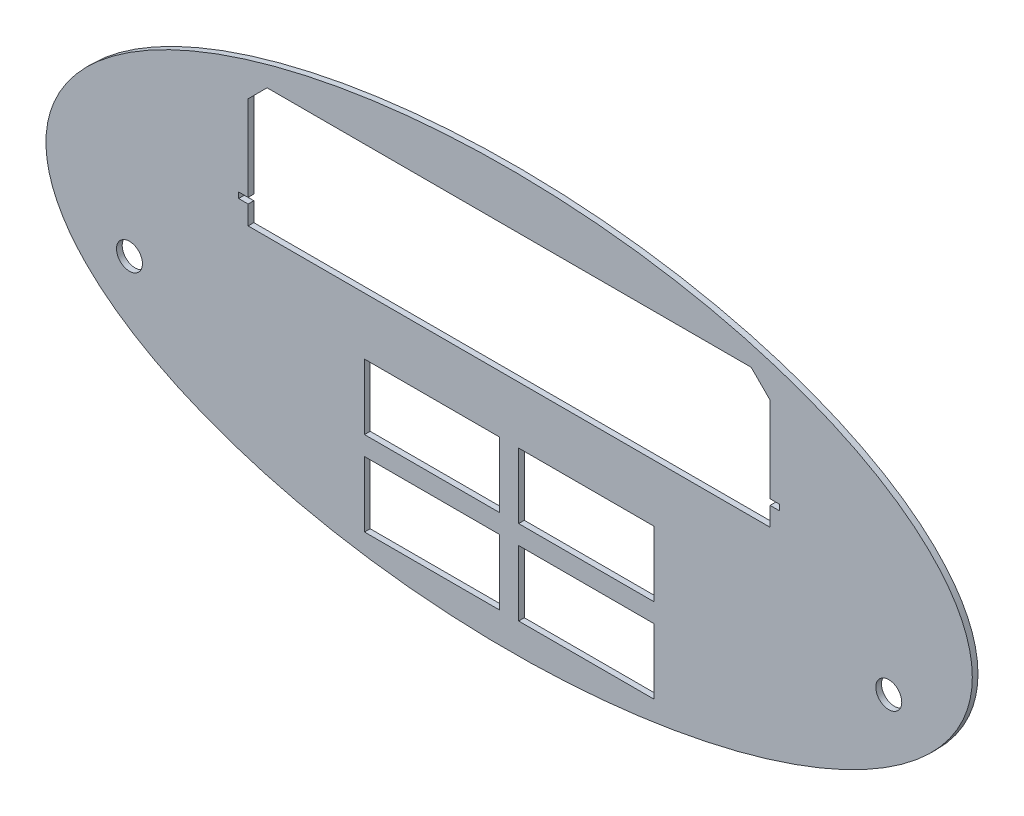
ISO-10303-21;
HEADER;
FILE_DESCRIPTION(('STEP AP214'),'2;1');
FILE_NAME('part.step','',(''),(''),'','','');
FILE_SCHEMA(('AUTOMOTIVE_DESIGN { 1 0 10303 214 1 1 1 1 }'));
ENDSEC;
DATA;
#1=APPLICATION_CONTEXT('core data for automotive mechanical design processes');
#2=APPLICATION_PROTOCOL_DEFINITION('international standard','automotive_design',2000,#1);
#3=PRODUCT_CONTEXT('',#1,'mechanical');
#4=PRODUCT('Part','Part','',(#3));
#5=PRODUCT_RELATED_PRODUCT_CATEGORY('part','',(#4));
#6=PRODUCT_DEFINITION_FORMATION('','',#4);
#7=PRODUCT_DEFINITION_CONTEXT('part definition',#1,'design');
#8=PRODUCT_DEFINITION('design','',#6,#7);
#9=PRODUCT_DEFINITION_SHAPE('','',#8);
#10=(LENGTH_UNIT() NAMED_UNIT(*) SI_UNIT(.MILLI.,.METRE.));
#11=(NAMED_UNIT(*) PLANE_ANGLE_UNIT() SI_UNIT($,.RADIAN.));
#12=(NAMED_UNIT(*) SI_UNIT($,.STERADIAN.) SOLID_ANGLE_UNIT());
#13=UNCERTAINTY_MEASURE_WITH_UNIT(LENGTH_MEASURE(1.E-05),#10,'distance_accuracy_value','');
#14=(GEOMETRIC_REPRESENTATION_CONTEXT(3) GLOBAL_UNCERTAINTY_ASSIGNED_CONTEXT((#13)) GLOBAL_UNIT_ASSIGNED_CONTEXT((#10,
#11,#12)) REPRESENTATION_CONTEXT('',''));
#15=CARTESIAN_POINT('',(0.,0.,0.));
#16=DIRECTION('',(0.,0.,1.));
#17=DIRECTION('',(1.,0.,0.));
#18=AXIS2_PLACEMENT_3D('',#15,#16,#17);
#19=CARTESIAN_POINT('',(0.,0.,-3.));
#20=DIRECTION('',(0.,0.,1.));
#21=DIRECTION('',(1.,0.,0.));
#22=AXIS2_PLACEMENT_3D('',#19,#20,#21);
#23=ELLIPSE('',#22,244.,110.);
#24=DIRECTION('',(0.,0.,1.));
#25=VECTOR('',#24,1.);
#26=SURFACE_OF_LINEAR_EXTRUSION('',#23,#25);
#27=CARTESIAN_POINT('',(244.,0.,-3.));
#28=VERTEX_POINT('',#27);
#29=EDGE_CURVE('E465',#28,#28,#23,.T.);
#30=ORIENTED_EDGE('',*,*,#29,.T.);
#31=EDGE_LOOP('',(#30));
#32=FACE_BOUND('',#31,.T.);
#33=CARTESIAN_POINT('',(0.,0.,0.));
#34=DIRECTION('',(0.,0.,1.));
#35=DIRECTION('',(1.,0.,0.));
#36=AXIS2_PLACEMENT_3D('',#33,#34,#35);
#37=ELLIPSE('',#36,244.,110.);
#38=CARTESIAN_POINT('',(244.,0.,0.));
#39=VERTEX_POINT('',#38);
#40=EDGE_CURVE('E446',#39,#39,#37,.T.);
#41=ORIENTED_EDGE('',*,*,#40,.F.);
#42=EDGE_LOOP('',(#41));
#43=FACE_BOUND('',#42,.T.);
#44=ADVANCED_FACE('F35',(#32,#43),#26,.T.);
#45=CARTESIAN_POINT('',(0.,0.,-3.));
#46=DIRECTION('',(0.,0.,1.));
#47=DIRECTION('',(1.,0.,0.));
#48=AXIS2_PLACEMENT_3D('',#45,#46,#47);
#49=PLANE('',#48);
#50=CARTESIAN_POINT('',(200.,-30.,-3.));
#51=DIRECTION('',(0.,0.,1.));
#52=DIRECTION('',(1.,0.,0.));
#53=AXIS2_PLACEMENT_3D('',#50,#51,#52);
#54=CIRCLE('',#53,6.83635541999999);
#55=CARTESIAN_POINT('',(206.83635542,-30.,-3.));
#56=VERTEX_POINT('',#55);
#57=EDGE_CURVE('E328',#56,#56,#54,.T.);
#58=ORIENTED_EDGE('',*,*,#57,.T.);
#59=EDGE_LOOP('',(#58));
#60=FACE_BOUND('',#59,.T.);
#61=CARTESIAN_POINT('',(-200.,-30.,-3.));
#62=DIRECTION('',(0.,0.,1.));
#63=DIRECTION('',(-1.,0.,0.));
#64=AXIS2_PLACEMENT_3D('',#61,#62,#63);
#65=CIRCLE('',#64,6.83635541999999);
#66=CARTESIAN_POINT('',(-206.83635542,-30.,-3.));
#67=VERTEX_POINT('',#66);
#68=EDGE_CURVE('E593',#67,#67,#65,.T.);
#69=ORIENTED_EDGE('',*,*,#68,.T.);
#70=EDGE_LOOP('',(#69));
#71=FACE_BOUND('',#70,.T.);
#72=DIRECTION('',(0.,1.,0.));
#73=VECTOR('',#72,1.);
#74=CARTESIAN_POINT('',(76.2,-15.,-3.));
#75=LINE('',#74,#73);
#76=CARTESIAN_POINT('',(76.2,-49.45,-3.));
#77=VERTEX_POINT('',#76);
#78=CARTESIAN_POINT('',(76.2,-15.,-3.));
#79=VERTEX_POINT('',#78);
#80=EDGE_CURVE('E321',#77,#79,#75,.T.);
#81=ORIENTED_EDGE('',*,*,#80,.T.);
#82=DIRECTION('',(-1.,0.,0.));
#83=VECTOR('',#82,1.);
#84=CARTESIAN_POINT('',(5.,-15.,-3.));
#85=LINE('',#84,#83);
#86=CARTESIAN_POINT('',(5.,-15.,-3.));
#87=VERTEX_POINT('',#86);
#88=EDGE_CURVE('E311',#79,#87,#85,.T.);
#89=ORIENTED_EDGE('',*,*,#88,.T.);
#90=DIRECTION('',(0.,-1.,0.));
#91=VECTOR('',#90,1.);
#92=CARTESIAN_POINT('',(5.,-15.,-3.));
#93=LINE('',#92,#91);
#94=CARTESIAN_POINT('',(5.00000000000001,-49.45,-3.));
#95=VERTEX_POINT('',#94);
#96=EDGE_CURVE('E314',#87,#95,#93,.T.);
#97=ORIENTED_EDGE('',*,*,#96,.T.);
#98=DIRECTION('',(1.,0.,0.));
#99=VECTOR('',#98,1.);
#100=CARTESIAN_POINT('',(5.00000000000001,-49.45,-3.));
#101=LINE('',#100,#99);
#102=EDGE_CURVE('E318',#95,#77,#101,.T.);
#103=ORIENTED_EDGE('',*,*,#102,.T.);
#104=EDGE_LOOP('',(#81,#89,#97,#103));
#105=FACE_BOUND('',#104,.T.);
#106=DIRECTION('',(-1.,0.,0.));
#107=VECTOR('',#106,1.);
#108=CARTESIAN_POINT('',(-76.2,-59.45,-3.));
#109=LINE('',#108,#107);
#110=CARTESIAN_POINT('',(-4.99999999999999,-59.45,-3.));
#111=VERTEX_POINT('',#110);
#112=CARTESIAN_POINT('',(-76.2,-59.45,-3.));
#113=VERTEX_POINT('',#112);
#114=EDGE_CURVE('E289',#111,#113,#109,.T.);
#115=ORIENTED_EDGE('',*,*,#114,.T.);
#116=DIRECTION('',(0.,-1.,0.));
#117=VECTOR('',#116,1.);
#118=CARTESIAN_POINT('',(-76.2,-59.45,-3.));
#119=LINE('',#118,#117);
#120=CARTESIAN_POINT('',(-76.2,-93.9,-3.));
#121=VERTEX_POINT('',#120);
#122=EDGE_CURVE('E279',#113,#121,#119,.T.);
#123=ORIENTED_EDGE('',*,*,#122,.T.);
#124=DIRECTION('',(1.,0.,0.));
#125=VECTOR('',#124,1.);
#126=CARTESIAN_POINT('',(-76.2,-93.9,-3.));
#127=LINE('',#126,#125);
#128=CARTESIAN_POINT('',(-4.99999999999999,-93.9,-3.));
#129=VERTEX_POINT('',#128);
#130=EDGE_CURVE('E282',#121,#129,#127,.T.);
#131=ORIENTED_EDGE('',*,*,#130,.T.);
#132=DIRECTION('',(0.,1.,0.));
#133=VECTOR('',#132,1.);
#134=CARTESIAN_POINT('',(-4.99999999999999,-59.45,-3.));
#135=LINE('',#134,#133);
#136=EDGE_CURVE('E286',#129,#111,#135,.T.);
#137=ORIENTED_EDGE('',*,*,#136,.T.);
#138=EDGE_LOOP('',(#115,#123,#131,#137));
#139=FACE_BOUND('',#138,.T.);
#140=DIRECTION('',(1.,0.,0.));
#141=VECTOR('',#140,1.);
#142=CARTESIAN_POINT('',(5.00000000000001,-93.9,-3.));
#143=LINE('',#142,#141);
#144=CARTESIAN_POINT('',(5.00000000000001,-93.9,-3.));
#145=VERTEX_POINT('',#144);
#146=CARTESIAN_POINT('',(76.2,-93.9,-3.));
#147=VERTEX_POINT('',#146);
#148=EDGE_CURVE('E243',#145,#147,#143,.T.);
#149=ORIENTED_EDGE('',*,*,#148,.T.);
#150=DIRECTION('',(0.,1.,0.));
#151=VECTOR('',#150,1.);
#152=CARTESIAN_POINT('',(76.2,-59.45,-3.));
#153=LINE('',#152,#151);
#154=CARTESIAN_POINT('',(76.2,-59.45,-3.));
#155=VERTEX_POINT('',#154);
#156=EDGE_CURVE('E235',#147,#155,#153,.T.);
#157=ORIENTED_EDGE('',*,*,#156,.T.);
#158=DIRECTION('',(-1.,0.,0.));
#159=VECTOR('',#158,1.);
#160=CARTESIAN_POINT('',(5.00000000000001,-59.45,-3.));
#161=LINE('',#160,#159);
#162=CARTESIAN_POINT('',(5.00000000000001,-59.45,-3.));
#163=VERTEX_POINT('',#162);
#164=EDGE_CURVE('E247',#155,#163,#161,.T.);
#165=ORIENTED_EDGE('',*,*,#164,.T.);
#166=DIRECTION('',(0.,-1.,0.));
#167=VECTOR('',#166,1.);
#168=CARTESIAN_POINT('',(5.00000000000001,-59.45,-3.));
#169=LINE('',#168,#167);
#170=EDGE_CURVE('E251',#163,#145,#169,.T.);
#171=ORIENTED_EDGE('',*,*,#170,.T.);
#172=EDGE_LOOP('',(#149,#157,#165,#171));
#173=FACE_BOUND('',#172,.T.);
#174=DIRECTION('',(-1.,0.,0.));
#175=VECTOR('',#174,1.);
#176=CARTESIAN_POINT('',(-76.2,-15.,-3.));
#177=LINE('',#176,#175);
#178=CARTESIAN_POINT('',(-5.,-15.,-3.));
#179=VERTEX_POINT('',#178);
#180=CARTESIAN_POINT('',(-76.2,-15.,-3.));
#181=VERTEX_POINT('',#180);
#182=EDGE_CURVE('E353',#179,#181,#177,.T.);
#183=ORIENTED_EDGE('',*,*,#182,.T.);
#184=DIRECTION('',(0.,-1.,0.));
#185=VECTOR('',#184,1.);
#186=CARTESIAN_POINT('',(-76.2,-15.,-3.));
#187=LINE('',#186,#185);
#188=CARTESIAN_POINT('',(-76.2,-49.45,-3.));
#189=VERTEX_POINT('',#188);
#190=EDGE_CURVE('E343',#181,#189,#187,.T.);
#191=ORIENTED_EDGE('',*,*,#190,.T.);
#192=DIRECTION('',(1.,0.,0.));
#193=VECTOR('',#192,1.);
#194=CARTESIAN_POINT('',(-76.2,-49.45,-3.));
#195=LINE('',#194,#193);
#196=CARTESIAN_POINT('',(-4.99999999999999,-49.45,-3.));
#197=VERTEX_POINT('',#196);
#198=EDGE_CURVE('E346',#189,#197,#195,.T.);
#199=ORIENTED_EDGE('',*,*,#198,.T.);
#200=DIRECTION('',(0.,1.,0.));
#201=VECTOR('',#200,1.);
#202=CARTESIAN_POINT('',(-5.,-15.,-3.));
#203=LINE('',#202,#201);
#204=EDGE_CURVE('E350',#197,#179,#203,.T.);
#205=ORIENTED_EDGE('',*,*,#204,.T.);
#206=EDGE_LOOP('',(#183,#191,#199,#205));
#207=FACE_BOUND('',#206,.T.);
#208=DIRECTION('',(0.,1.,0.));
#209=VECTOR('',#208,1.);
#210=CARTESIAN_POINT('',(137.5,83.1000000000001,-3.));
#211=LINE('',#210,#209);
#212=CARTESIAN_POINT('',(137.5,28.1000000000001,-3.));
#213=VERTEX_POINT('',#212);
#214=CARTESIAN_POINT('',(137.5,73.1,-3.));
#215=VERTEX_POINT('',#214);
#216=EDGE_CURVE('E405',#213,#215,#211,.T.);
#217=ORIENTED_EDGE('',*,*,#216,.T.);
#218=DIRECTION('',(0.707106781186549,-0.707106781186546,0.));
#219=VECTOR('',#218,1.);
#220=CARTESIAN_POINT('',(105.3,105.3,-3.));
#221=LINE('',#220,#219);
#222=CARTESIAN_POINT('',(127.5,83.1000000000001,-3.));
#223=VERTEX_POINT('',#222);
#224=EDGE_CURVE('E491',#215,#223,#221,.F.);
#225=ORIENTED_EDGE('',*,*,#224,.T.);
#226=DIRECTION('',(-1.,0.,0.));
#227=VECTOR('',#226,1.);
#228=CARTESIAN_POINT('',(-137.5,83.1,-3.));
#229=LINE('',#228,#227);
#230=CARTESIAN_POINT('',(-127.5,83.1,-3.));
#231=VERTEX_POINT('',#230);
#232=EDGE_CURVE('E408',#223,#231,#229,.T.);
#233=ORIENTED_EDGE('',*,*,#232,.T.);
#234=DIRECTION('',(0.707106781186544,0.707106781186551,0.));
#235=VECTOR('',#234,1.);
#236=CARTESIAN_POINT('',(-105.300000000001,105.3,-3.));
#237=LINE('',#236,#235);
#238=CARTESIAN_POINT('',(-137.5,73.1,-3.));
#239=VERTEX_POINT('',#238);
#240=EDGE_CURVE('E11',#231,#239,#237,.F.);
#241=ORIENTED_EDGE('',*,*,#240,.T.);
#242=DIRECTION('',(0.,-1.,0.));
#243=VECTOR('',#242,1.);
#244=CARTESIAN_POINT('',(-137.5,83.1,-3.));
#245=LINE('',#244,#243);
#246=CARTESIAN_POINT('',(-137.5,28.1,-3.));
#247=VERTEX_POINT('',#246);
#248=EDGE_CURVE('E375',#239,#247,#245,.T.);
#249=ORIENTED_EDGE('',*,*,#248,.T.);
#250=DIRECTION('',(-1.,0.,0.));
#251=VECTOR('',#250,1.);
#252=CARTESIAN_POINT('',(-137.5,28.1,-3.));
#253=LINE('',#252,#251);
#254=CARTESIAN_POINT('',(-142.5,28.1,-3.));
#255=VERTEX_POINT('',#254);
#256=EDGE_CURVE('E377',#247,#255,#253,.T.);
#257=ORIENTED_EDGE('',*,*,#256,.T.);
#258=DIRECTION('',(0.,-1.,0.));
#259=VECTOR('',#258,1.);
#260=CARTESIAN_POINT('',(-142.5,28.1,-3.));
#261=LINE('',#260,#259);
#262=CARTESIAN_POINT('',(-142.5,25.1,-3.));
#263=VERTEX_POINT('',#262);
#264=EDGE_CURVE('E381',#255,#263,#261,.T.);
#265=ORIENTED_EDGE('',*,*,#264,.T.);
#266=DIRECTION('',(1.,0.,0.));
#267=VECTOR('',#266,1.);
#268=CARTESIAN_POINT('',(-142.5,25.1,-3.));
#269=LINE('',#268,#267);
#270=CARTESIAN_POINT('',(-137.5,25.1,-3.));
#271=VERTEX_POINT('',#270);
#272=EDGE_CURVE('E384',#263,#271,#269,.T.);
#273=ORIENTED_EDGE('',*,*,#272,.T.);
#274=DIRECTION('',(0.,-1.,0.));
#275=VECTOR('',#274,1.);
#276=CARTESIAN_POINT('',(-137.5,25.1,-3.));
#277=LINE('',#276,#275);
#278=CARTESIAN_POINT('',(-137.5,15.1,-3.));
#279=VERTEX_POINT('',#278);
#280=EDGE_CURVE('E387',#271,#279,#277,.T.);
#281=ORIENTED_EDGE('',*,*,#280,.T.);
#282=DIRECTION('',(1.,0.,0.));
#283=VECTOR('',#282,1.);
#284=CARTESIAN_POINT('',(137.5,15.1,-3.));
#285=LINE('',#284,#283);
#286=CARTESIAN_POINT('',(137.5,15.1,-3.));
#287=VERTEX_POINT('',#286);
#288=EDGE_CURVE('E390',#279,#287,#285,.T.);
#289=ORIENTED_EDGE('',*,*,#288,.T.);
#290=DIRECTION('',(0.,1.,0.));
#291=VECTOR('',#290,1.);
#292=CARTESIAN_POINT('',(137.5,25.1,-3.));
#293=LINE('',#292,#291);
#294=CARTESIAN_POINT('',(137.5,25.1,-3.));
#295=VERTEX_POINT('',#294);
#296=EDGE_CURVE('E393',#287,#295,#293,.T.);
#297=ORIENTED_EDGE('',*,*,#296,.T.);
#298=DIRECTION('',(1.,0.,0.));
#299=VECTOR('',#298,1.);
#300=CARTESIAN_POINT('',(142.5,25.1,-3.));
#301=LINE('',#300,#299);
#302=CARTESIAN_POINT('',(142.5,25.1,-3.));
#303=VERTEX_POINT('',#302);
#304=EDGE_CURVE('E396',#295,#303,#301,.T.);
#305=ORIENTED_EDGE('',*,*,#304,.T.);
#306=DIRECTION('',(0.,1.,0.));
#307=VECTOR('',#306,1.);
#308=CARTESIAN_POINT('',(142.5,28.1,-3.));
#309=LINE('',#308,#307);
#310=CARTESIAN_POINT('',(142.5,28.1,-3.));
#311=VERTEX_POINT('',#310);
#312=EDGE_CURVE('E399',#303,#311,#309,.T.);
#313=ORIENTED_EDGE('',*,*,#312,.T.);
#314=DIRECTION('',(-1.,0.,0.));
#315=VECTOR('',#314,1.);
#316=CARTESIAN_POINT('',(137.5,28.1000000000001,-3.));
#317=LINE('',#316,#315);
#318=EDGE_CURVE('E402',#311,#213,#317,.T.);
#319=ORIENTED_EDGE('',*,*,#318,.T.);
#320=EDGE_LOOP('',(#217,#225,#233,#241,#249,#257,#265,#273,#281,#289,#297,#305,#313,#319));
#321=FACE_BOUND('',#320,.T.);
#322=ORIENTED_EDGE('',*,*,#29,.F.);
#323=EDGE_LOOP('',(#322));
#324=FACE_BOUND('',#323,.T.);
#325=ADVANCED_FACE('F253',(#60,#71,#105,#139,#173,#207,#321,#324),#49,.F.);
#326=CARTESIAN_POINT('',(0.,0.,0.));
#327=DIRECTION('',(0.,0.,1.));
#328=DIRECTION('',(1.,0.,0.));
#329=AXIS2_PLACEMENT_3D('',#326,#327,#328);
#330=PLANE('',#329);
#331=CARTESIAN_POINT('',(200.,-30.,0.));
#332=DIRECTION('',(0.,0.,1.));
#333=DIRECTION('',(1.,0.,0.));
#334=AXIS2_PLACEMENT_3D('',#331,#332,#333);
#335=CIRCLE('',#334,6.83635541999999);
#336=CARTESIAN_POINT('',(206.83635542,-30.,0.));
#337=VERTEX_POINT('',#336);
#338=EDGE_CURVE('E885',#337,#337,#335,.T.);
#339=ORIENTED_EDGE('',*,*,#338,.F.);
#340=EDGE_LOOP('',(#339));
#341=FACE_BOUND('',#340,.T.);
#342=CARTESIAN_POINT('',(-200.,-30.,0.));
#343=DIRECTION('',(0.,0.,1.));
#344=DIRECTION('',(-1.,0.,0.));
#345=AXIS2_PLACEMENT_3D('',#342,#343,#344);
#346=CIRCLE('',#345,6.83635541999999);
#347=CARTESIAN_POINT('',(-206.83635542,-30.,0.));
#348=VERTEX_POINT('',#347);
#349=EDGE_CURVE('E262',#348,#348,#346,.T.);
#350=ORIENTED_EDGE('',*,*,#349,.F.);
#351=EDGE_LOOP('',(#350));
#352=FACE_BOUND('',#351,.T.);
#353=DIRECTION('',(-1.,0.,0.));
#354=VECTOR('',#353,1.);
#355=CARTESIAN_POINT('',(5.,-15.,0.));
#356=LINE('',#355,#354);
#357=CARTESIAN_POINT('',(76.2,-15.,0.));
#358=VERTEX_POINT('',#357);
#359=CARTESIAN_POINT('',(5.,-15.,0.));
#360=VERTEX_POINT('',#359);
#361=EDGE_CURVE('E325',#358,#360,#356,.T.);
#362=ORIENTED_EDGE('',*,*,#361,.F.);
#363=DIRECTION('',(0.,1.,0.));
#364=VECTOR('',#363,1.);
#365=CARTESIAN_POINT('',(76.2,-15.,0.));
#366=LINE('',#365,#364);
#367=CARTESIAN_POINT('',(76.2,-49.45,0.));
#368=VERTEX_POINT('',#367);
#369=EDGE_CURVE('E315',#368,#358,#366,.T.);
#370=ORIENTED_EDGE('',*,*,#369,.F.);
#371=DIRECTION('',(1.,0.,0.));
#372=VECTOR('',#371,1.);
#373=CARTESIAN_POINT('',(5.00000000000001,-49.45,0.));
#374=LINE('',#373,#372);
#375=CARTESIAN_POINT('',(5.00000000000001,-49.45,0.));
#376=VERTEX_POINT('',#375);
#377=EDGE_CURVE('E331',#376,#368,#374,.T.);
#378=ORIENTED_EDGE('',*,*,#377,.F.);
#379=DIRECTION('',(0.,-1.,0.));
#380=VECTOR('',#379,1.);
#381=CARTESIAN_POINT('',(5.,-15.,0.));
#382=LINE('',#381,#380);
#383=EDGE_CURVE('E327',#360,#376,#382,.T.);
#384=ORIENTED_EDGE('',*,*,#383,.F.);
#385=EDGE_LOOP('',(#362,#370,#378,#384));
#386=FACE_BOUND('',#385,.T.);
#387=DIRECTION('',(0.,-1.,0.));
#388=VECTOR('',#387,1.);
#389=CARTESIAN_POINT('',(-76.2,-59.45,0.));
#390=LINE('',#389,#388);
#391=CARTESIAN_POINT('',(-76.2,-59.45,0.));
#392=VERTEX_POINT('',#391);
#393=CARTESIAN_POINT('',(-76.2,-93.9,0.));
#394=VERTEX_POINT('',#393);
#395=EDGE_CURVE('E293',#392,#394,#390,.T.);
#396=ORIENTED_EDGE('',*,*,#395,.F.);
#397=DIRECTION('',(-1.,0.,0.));
#398=VECTOR('',#397,1.);
#399=CARTESIAN_POINT('',(-76.2,-59.45,0.));
#400=LINE('',#399,#398);
#401=CARTESIAN_POINT('',(-4.99999999999999,-59.45,0.));
#402=VERTEX_POINT('',#401);
#403=EDGE_CURVE('E283',#402,#392,#400,.T.);
#404=ORIENTED_EDGE('',*,*,#403,.F.);
#405=DIRECTION('',(0.,1.,0.));
#406=VECTOR('',#405,1.);
#407=CARTESIAN_POINT('',(-4.99999999999999,-59.45,0.));
#408=LINE('',#407,#406);
#409=CARTESIAN_POINT('',(-4.99999999999999,-93.9,0.));
#410=VERTEX_POINT('',#409);
#411=EDGE_CURVE('E299',#410,#402,#408,.T.);
#412=ORIENTED_EDGE('',*,*,#411,.F.);
#413=DIRECTION('',(1.,0.,0.));
#414=VECTOR('',#413,1.);
#415=CARTESIAN_POINT('',(-76.2,-93.9,0.));
#416=LINE('',#415,#414);
#417=EDGE_CURVE('E295',#394,#410,#416,.T.);
#418=ORIENTED_EDGE('',*,*,#417,.F.);
#419=EDGE_LOOP('',(#396,#404,#412,#418));
#420=FACE_BOUND('',#419,.T.);
#421=DIRECTION('',(0.,1.,0.));
#422=VECTOR('',#421,1.);
#423=CARTESIAN_POINT('',(76.2,-59.45,0.));
#424=LINE('',#423,#422);
#425=CARTESIAN_POINT('',(76.2,-93.9,0.));
#426=VERTEX_POINT('',#425);
#427=CARTESIAN_POINT('',(76.2,-59.45,0.));
#428=VERTEX_POINT('',#427);
#429=EDGE_CURVE('E238',#426,#428,#424,.T.);
#430=ORIENTED_EDGE('',*,*,#429,.F.);
#431=DIRECTION('',(1.,0.,0.));
#432=VECTOR('',#431,1.);
#433=CARTESIAN_POINT('',(5.00000000000001,-93.9,0.));
#434=LINE('',#433,#432);
#435=CARTESIAN_POINT('',(5.00000000000001,-93.9,0.));
#436=VERTEX_POINT('',#435);
#437=EDGE_CURVE('E256',#436,#426,#434,.T.);
#438=ORIENTED_EDGE('',*,*,#437,.F.);
#439=DIRECTION('',(0.,-1.,0.));
#440=VECTOR('',#439,1.);
#441=CARTESIAN_POINT('',(5.00000000000001,-59.45,0.));
#442=LINE('',#441,#440);
#443=CARTESIAN_POINT('',(5.00000000000001,-59.45,0.));
#444=VERTEX_POINT('',#443);
#445=EDGE_CURVE('E259',#444,#436,#442,.T.);
#446=ORIENTED_EDGE('',*,*,#445,.F.);
#447=DIRECTION('',(-1.,0.,0.));
#448=VECTOR('',#447,1.);
#449=CARTESIAN_POINT('',(5.00000000000001,-59.45,0.));
#450=LINE('',#449,#448);
#451=EDGE_CURVE('E268',#428,#444,#450,.T.);
#452=ORIENTED_EDGE('',*,*,#451,.F.);
#453=EDGE_LOOP('',(#430,#438,#446,#452));
#454=FACE_BOUND('',#453,.T.);
#455=DIRECTION('',(0.,-1.,0.));
#456=VECTOR('',#455,1.);
#457=CARTESIAN_POINT('',(-76.2,-15.,0.));
#458=LINE('',#457,#456);
#459=CARTESIAN_POINT('',(-76.2,-15.,0.));
#460=VERTEX_POINT('',#459);
#461=CARTESIAN_POINT('',(-76.2,-49.45,0.));
#462=VERTEX_POINT('',#461);
#463=EDGE_CURVE('E275',#460,#462,#458,.T.);
#464=ORIENTED_EDGE('',*,*,#463,.F.);
#465=DIRECTION('',(-1.,0.,0.));
#466=VECTOR('',#465,1.);
#467=CARTESIAN_POINT('',(-76.2,-15.,0.));
#468=LINE('',#467,#466);
#469=CARTESIAN_POINT('',(-5.,-15.,0.));
#470=VERTEX_POINT('',#469);
#471=EDGE_CURVE('E347',#470,#460,#468,.T.);
#472=ORIENTED_EDGE('',*,*,#471,.F.);
#473=DIRECTION('',(0.,1.,0.));
#474=VECTOR('',#473,1.);
#475=CARTESIAN_POINT('',(-5.,-15.,0.));
#476=LINE('',#475,#474);
#477=CARTESIAN_POINT('',(-4.99999999999999,-49.45,0.));
#478=VERTEX_POINT('',#477);
#479=EDGE_CURVE('E361',#478,#470,#476,.T.);
#480=ORIENTED_EDGE('',*,*,#479,.F.);
#481=DIRECTION('',(1.,0.,0.));
#482=VECTOR('',#481,1.);
#483=CARTESIAN_POINT('',(-76.2,-49.45,0.));
#484=LINE('',#483,#482);
#485=EDGE_CURVE('E358',#462,#478,#484,.T.);
#486=ORIENTED_EDGE('',*,*,#485,.F.);
#487=EDGE_LOOP('',(#464,#472,#480,#486));
#488=FACE_BOUND('',#487,.T.);
#489=DIRECTION('',(0.,-1.,0.));
#490=VECTOR('',#489,1.);
#491=CARTESIAN_POINT('',(-137.5,83.1,0.));
#492=LINE('',#491,#490);
#493=CARTESIAN_POINT('',(-137.5,73.1,0.));
#494=VERTEX_POINT('',#493);
#495=CARTESIAN_POINT('',(-137.5,28.1,0.));
#496=VERTEX_POINT('',#495);
#497=EDGE_CURVE('E368',#494,#496,#492,.T.);
#498=ORIENTED_EDGE('',*,*,#497,.F.);
#499=DIRECTION('',(-0.707106781186544,-0.707106781186551,0.));
#500=VECTOR('',#499,1.);
#501=CARTESIAN_POINT('',(-137.5,73.1,0.));
#502=LINE('',#501,#500);
#503=CARTESIAN_POINT('',(-127.5,83.1,0.));
#504=VERTEX_POINT('',#503);
#505=EDGE_CURVE('E43',#494,#504,#502,.F.);
#506=ORIENTED_EDGE('',*,*,#505,.T.);
#507=DIRECTION('',(-1.,0.,0.));
#508=VECTOR('',#507,1.);
#509=CARTESIAN_POINT('',(-137.5,83.1,0.));
#510=LINE('',#509,#508);
#511=CARTESIAN_POINT('',(127.5,83.1000000000001,0.));
#512=VERTEX_POINT('',#511);
#513=EDGE_CURVE('E378',#512,#504,#510,.T.);
#514=ORIENTED_EDGE('',*,*,#513,.F.);
#515=DIRECTION('',(-0.707106781186549,0.707106781186546,0.));
#516=VECTOR('',#515,1.);
#517=CARTESIAN_POINT('',(127.5,83.1000000000001,0.));
#518=LINE('',#517,#516);
#519=CARTESIAN_POINT('',(137.5,73.1,0.));
#520=VERTEX_POINT('',#519);
#521=EDGE_CURVE('E496',#512,#520,#518,.F.);
#522=ORIENTED_EDGE('',*,*,#521,.T.);
#523=DIRECTION('',(0.,1.,0.));
#524=VECTOR('',#523,1.);
#525=CARTESIAN_POINT('',(137.5,83.1000000000001,0.));
#526=LINE('',#525,#524);
#527=CARTESIAN_POINT('',(137.5,28.1000000000001,0.));
#528=VERTEX_POINT('',#527);
#529=EDGE_CURVE('E439',#528,#520,#526,.T.);
#530=ORIENTED_EDGE('',*,*,#529,.F.);
#531=DIRECTION('',(-1.,0.,0.));
#532=VECTOR('',#531,1.);
#533=CARTESIAN_POINT('',(137.5,28.1000000000001,0.));
#534=LINE('',#533,#532);
#535=CARTESIAN_POINT('',(142.5,28.1,0.));
#536=VERTEX_POINT('',#535);
#537=EDGE_CURVE('E436',#536,#528,#534,.T.);
#538=ORIENTED_EDGE('',*,*,#537,.F.);
#539=DIRECTION('',(0.,1.,0.));
#540=VECTOR('',#539,1.);
#541=CARTESIAN_POINT('',(142.5,28.1,0.));
#542=LINE('',#541,#540);
#543=CARTESIAN_POINT('',(142.5,25.1,0.));
#544=VERTEX_POINT('',#543);
#545=EDGE_CURVE('E433',#544,#536,#542,.T.);
#546=ORIENTED_EDGE('',*,*,#545,.F.);
#547=DIRECTION('',(1.,0.,0.));
#548=VECTOR('',#547,1.);
#549=CARTESIAN_POINT('',(142.5,25.1,0.));
#550=LINE('',#549,#548);
#551=CARTESIAN_POINT('',(137.5,25.1,0.));
#552=VERTEX_POINT('',#551);
#553=EDGE_CURVE('E430',#552,#544,#550,.T.);
#554=ORIENTED_EDGE('',*,*,#553,.F.);
#555=DIRECTION('',(0.,1.,0.));
#556=VECTOR('',#555,1.);
#557=CARTESIAN_POINT('',(137.5,25.1,0.));
#558=LINE('',#557,#556);
#559=CARTESIAN_POINT('',(137.5,15.1,0.));
#560=VERTEX_POINT('',#559);
#561=EDGE_CURVE('E427',#560,#552,#558,.T.);
#562=ORIENTED_EDGE('',*,*,#561,.F.);
#563=DIRECTION('',(1.,0.,0.));
#564=VECTOR('',#563,1.);
#565=CARTESIAN_POINT('',(137.5,15.1,0.));
#566=LINE('',#565,#564);
#567=CARTESIAN_POINT('',(-137.5,15.1,0.));
#568=VERTEX_POINT('',#567);
#569=EDGE_CURVE('E424',#568,#560,#566,.T.);
#570=ORIENTED_EDGE('',*,*,#569,.F.);
#571=DIRECTION('',(0.,-1.,0.));
#572=VECTOR('',#571,1.);
#573=CARTESIAN_POINT('',(-137.5,25.1,0.));
#574=LINE('',#573,#572);
#575=CARTESIAN_POINT('',(-137.5,25.1,0.));
#576=VERTEX_POINT('',#575);
#577=EDGE_CURVE('E421',#576,#568,#574,.T.);
#578=ORIENTED_EDGE('',*,*,#577,.F.);
#579=DIRECTION('',(1.,0.,0.));
#580=VECTOR('',#579,1.);
#581=CARTESIAN_POINT('',(-142.5,25.1,0.));
#582=LINE('',#581,#580);
#583=CARTESIAN_POINT('',(-142.5,25.1,0.));
#584=VERTEX_POINT('',#583);
#585=EDGE_CURVE('E418',#584,#576,#582,.T.);
#586=ORIENTED_EDGE('',*,*,#585,.F.);
#587=DIRECTION('',(0.,-1.,0.));
#588=VECTOR('',#587,1.);
#589=CARTESIAN_POINT('',(-142.5,28.1,0.));
#590=LINE('',#589,#588);
#591=CARTESIAN_POINT('',(-142.5,28.1,0.));
#592=VERTEX_POINT('',#591);
#593=EDGE_CURVE('E415',#592,#584,#590,.T.);
#594=ORIENTED_EDGE('',*,*,#593,.F.);
#595=DIRECTION('',(-1.,0.,0.));
#596=VECTOR('',#595,1.);
#597=CARTESIAN_POINT('',(-137.5,28.1,0.));
#598=LINE('',#597,#596);
#599=EDGE_CURVE('E412',#496,#592,#598,.T.);
#600=ORIENTED_EDGE('',*,*,#599,.F.);
#601=EDGE_LOOP('',(#498,#506,#514,#522,#530,#538,#546,#554,#562,#570,#578,#586,#594,#600));
#602=FACE_BOUND('',#601,.T.);
#603=ORIENTED_EDGE('',*,*,#40,.T.);
#604=EDGE_LOOP('',(#603));
#605=FACE_BOUND('',#604,.T.);
#606=ADVANCED_FACE('F475',(#341,#352,#386,#420,#454,#488,#602,#605),#330,.T.);
#607=CARTESIAN_POINT('',(-137.5,83.1,-3.));
#608=DIRECTION('',(-1.,0.,0.));
#609=DIRECTION('',(0.,0.,1.));
#610=AXIS2_PLACEMENT_3D('',#607,#608,#609);
#611=PLANE('',#610);
#612=ORIENTED_EDGE('',*,*,#248,.F.);
#613=DIRECTION('',(0.,0.,1.));
#614=VECTOR('',#613,1.);
#615=CARTESIAN_POINT('',(-137.5,73.1,0.));
#616=LINE('',#615,#614);
#617=EDGE_CURVE('E498',#239,#494,#616,.T.);
#618=ORIENTED_EDGE('',*,*,#617,.T.);
#619=ORIENTED_EDGE('',*,*,#497,.T.);
#620=DIRECTION('',(0.,0.,1.));
#621=VECTOR('',#620,1.);
#622=CARTESIAN_POINT('',(-137.5,28.1,-3.));
#623=LINE('',#622,#621);
#624=EDGE_CURVE('E410',#247,#496,#623,.T.);
#625=ORIENTED_EDGE('',*,*,#624,.F.);
#626=EDGE_LOOP('',(#612,#618,#619,#625));
#627=FACE_BOUND('',#626,.T.);
#628=ADVANCED_FACE('F509',(#627),#611,.F.);
#629=CARTESIAN_POINT('',(-137.5,83.1,-3.));
#630=DIRECTION('',(0.,1.,0.));
#631=DIRECTION('',(-1.,0.,0.));
#632=AXIS2_PLACEMENT_3D('',#629,#630,#631);
#633=PLANE('',#632);
#634=ORIENTED_EDGE('',*,*,#232,.F.);
#635=DIRECTION('',(0.,0.,1.));
#636=VECTOR('',#635,1.);
#637=CARTESIAN_POINT('',(127.5,83.1000000000001,0.));
#638=LINE('',#637,#636);
#639=EDGE_CURVE('E494',#223,#512,#638,.T.);
#640=ORIENTED_EDGE('',*,*,#639,.T.);
#641=ORIENTED_EDGE('',*,*,#513,.T.);
#642=DIRECTION('',(0.,0.,-1.));
#643=VECTOR('',#642,1.);
#644=CARTESIAN_POINT('',(-127.5,83.1,-3.));
#645=LINE('',#644,#643);
#646=EDGE_CURVE('E469',#504,#231,#645,.T.);
#647=ORIENTED_EDGE('',*,*,#646,.T.);
#648=EDGE_LOOP('',(#634,#640,#641,#647));
#649=FACE_BOUND('',#648,.T.);
#650=ADVANCED_FACE('F504',(#649),#633,.F.);
#651=CARTESIAN_POINT('',(137.5,83.1000000000001,-3.));
#652=DIRECTION('',(1.,0.,0.));
#653=DIRECTION('',(0.,0.,-1.));
#654=AXIS2_PLACEMENT_3D('',#651,#652,#653);
#655=PLANE('',#654);
#656=ORIENTED_EDGE('',*,*,#529,.T.);
#657=DIRECTION('',(0.,0.,-1.));
#658=VECTOR('',#657,1.);
#659=CARTESIAN_POINT('',(137.5,73.1,-3.));
#660=LINE('',#659,#658);
#661=EDGE_CURVE('E492',#520,#215,#660,.T.);
#662=ORIENTED_EDGE('',*,*,#661,.T.);
#663=ORIENTED_EDGE('',*,*,#216,.F.);
#664=DIRECTION('',(0.,0.,1.));
#665=VECTOR('',#664,1.);
#666=CARTESIAN_POINT('',(137.5,28.1000000000001,-3.));
#667=LINE('',#666,#665);
#668=EDGE_CURVE('E444',#213,#528,#667,.T.);
#669=ORIENTED_EDGE('',*,*,#668,.T.);
#670=EDGE_LOOP('',(#656,#662,#663,#669));
#671=FACE_BOUND('',#670,.T.);
#672=ADVANCED_FACE('F552',(#671),#655,.F.);
#673=CARTESIAN_POINT('',(137.5,28.1000000000001,-3.));
#674=DIRECTION('',(0.,1.,0.));
#675=DIRECTION('',(-1.,0.,0.));
#676=AXIS2_PLACEMENT_3D('',#673,#674,#675);
#677=PLANE('',#676);
#678=ORIENTED_EDGE('',*,*,#537,.T.);
#679=ORIENTED_EDGE('',*,*,#668,.F.);
#680=ORIENTED_EDGE('',*,*,#318,.F.);
#681=DIRECTION('',(0.,0.,1.));
#682=VECTOR('',#681,1.);
#683=CARTESIAN_POINT('',(142.5,28.1,-3.));
#684=LINE('',#683,#682);
#685=EDGE_CURVE('E447',#311,#536,#684,.T.);
#686=ORIENTED_EDGE('',*,*,#685,.T.);
#687=EDGE_LOOP('',(#678,#679,#680,#686));
#688=FACE_BOUND('',#687,.T.);
#689=ADVANCED_FACE('F548',(#688),#677,.F.);
#690=CARTESIAN_POINT('',(142.5,28.1,-3.));
#691=DIRECTION('',(1.,0.,0.));
#692=DIRECTION('',(0.,0.,-1.));
#693=AXIS2_PLACEMENT_3D('',#690,#691,#692);
#694=PLANE('',#693);
#695=ORIENTED_EDGE('',*,*,#545,.T.);
#696=ORIENTED_EDGE('',*,*,#685,.F.);
#697=ORIENTED_EDGE('',*,*,#312,.F.);
#698=DIRECTION('',(0.,0.,1.));
#699=VECTOR('',#698,1.);
#700=CARTESIAN_POINT('',(142.5,25.1,-3.));
#701=LINE('',#700,#699);
#702=EDGE_CURVE('E449',#303,#544,#701,.T.);
#703=ORIENTED_EDGE('',*,*,#702,.T.);
#704=EDGE_LOOP('',(#695,#696,#697,#703));
#705=FACE_BOUND('',#704,.T.);
#706=ADVANCED_FACE('F544',(#705),#694,.F.);
#707=CARTESIAN_POINT('',(142.5,25.1,-3.));
#708=DIRECTION('',(0.,-1.,0.));
#709=DIRECTION('',(0.,0.,-1.));
#710=AXIS2_PLACEMENT_3D('',#707,#708,#709);
#711=PLANE('',#710);
#712=ORIENTED_EDGE('',*,*,#553,.T.);
#713=ORIENTED_EDGE('',*,*,#702,.F.);
#714=ORIENTED_EDGE('',*,*,#304,.F.);
#715=DIRECTION('',(0.,0.,1.));
#716=VECTOR('',#715,1.);
#717=CARTESIAN_POINT('',(137.5,25.1,-3.));
#718=LINE('',#717,#716);
#719=EDGE_CURVE('E451',#295,#552,#718,.T.);
#720=ORIENTED_EDGE('',*,*,#719,.T.);
#721=EDGE_LOOP('',(#712,#713,#714,#720));
#722=FACE_BOUND('',#721,.T.);
#723=ADVANCED_FACE('F540',(#722),#711,.F.);
#724=CARTESIAN_POINT('',(137.5,25.1,-3.));
#725=DIRECTION('',(1.,0.,0.));
#726=DIRECTION('',(0.,0.,-1.));
#727=AXIS2_PLACEMENT_3D('',#724,#725,#726);
#728=PLANE('',#727);
#729=ORIENTED_EDGE('',*,*,#561,.T.);
#730=ORIENTED_EDGE('',*,*,#719,.F.);
#731=ORIENTED_EDGE('',*,*,#296,.F.);
#732=DIRECTION('',(0.,0.,1.));
#733=VECTOR('',#732,1.);
#734=CARTESIAN_POINT('',(137.5,15.1,-3.));
#735=LINE('',#734,#733);
#736=EDGE_CURVE('E453',#287,#560,#735,.T.);
#737=ORIENTED_EDGE('',*,*,#736,.T.);
#738=EDGE_LOOP('',(#729,#730,#731,#737));
#739=FACE_BOUND('',#738,.T.);
#740=ADVANCED_FACE('F536',(#739),#728,.F.);
#741=CARTESIAN_POINT('',(137.5,15.1,-3.));
#742=DIRECTION('',(0.,-1.,0.));
#743=DIRECTION('',(0.,0.,-1.));
#744=AXIS2_PLACEMENT_3D('',#741,#742,#743);
#745=PLANE('',#744);
#746=ORIENTED_EDGE('',*,*,#569,.T.);
#747=ORIENTED_EDGE('',*,*,#736,.F.);
#748=ORIENTED_EDGE('',*,*,#288,.F.);
#749=DIRECTION('',(0.,0.,1.));
#750=VECTOR('',#749,1.);
#751=CARTESIAN_POINT('',(-137.5,15.1,-3.));
#752=LINE('',#751,#750);
#753=EDGE_CURVE('E455',#279,#568,#752,.T.);
#754=ORIENTED_EDGE('',*,*,#753,.T.);
#755=EDGE_LOOP('',(#746,#747,#748,#754));
#756=FACE_BOUND('',#755,.T.);
#757=ADVANCED_FACE('F532',(#756),#745,.F.);
#758=CARTESIAN_POINT('',(-137.5,25.1,-3.));
#759=DIRECTION('',(-1.,0.,0.));
#760=DIRECTION('',(0.,0.,1.));
#761=AXIS2_PLACEMENT_3D('',#758,#759,#760);
#762=PLANE('',#761);
#763=ORIENTED_EDGE('',*,*,#577,.T.);
#764=ORIENTED_EDGE('',*,*,#753,.F.);
#765=ORIENTED_EDGE('',*,*,#280,.F.);
#766=DIRECTION('',(0.,0.,1.));
#767=VECTOR('',#766,1.);
#768=CARTESIAN_POINT('',(-137.5,25.1,-3.));
#769=LINE('',#768,#767);
#770=EDGE_CURVE('E457',#271,#576,#769,.T.);
#771=ORIENTED_EDGE('',*,*,#770,.T.);
#772=EDGE_LOOP('',(#763,#764,#765,#771));
#773=FACE_BOUND('',#772,.T.);
#774=ADVANCED_FACE('F528',(#773),#762,.F.);
#775=CARTESIAN_POINT('',(-142.5,25.1,-3.));
#776=DIRECTION('',(0.,-1.,0.));
#777=DIRECTION('',(0.,0.,-1.));
#778=AXIS2_PLACEMENT_3D('',#775,#776,#777);
#779=PLANE('',#778);
#780=ORIENTED_EDGE('',*,*,#585,.T.);
#781=ORIENTED_EDGE('',*,*,#770,.F.);
#782=ORIENTED_EDGE('',*,*,#272,.F.);
#783=DIRECTION('',(0.,0.,1.));
#784=VECTOR('',#783,1.);
#785=CARTESIAN_POINT('',(-142.5,25.1,-3.));
#786=LINE('',#785,#784);
#787=EDGE_CURVE('E459',#263,#584,#786,.T.);
#788=ORIENTED_EDGE('',*,*,#787,.T.);
#789=EDGE_LOOP('',(#780,#781,#782,#788));
#790=FACE_BOUND('',#789,.T.);
#791=ADVANCED_FACE('F524',(#790),#779,.F.);
#792=CARTESIAN_POINT('',(-142.5,28.1,-3.));
#793=DIRECTION('',(-1.,0.,0.));
#794=DIRECTION('',(0.,0.,1.));
#795=AXIS2_PLACEMENT_3D('',#792,#793,#794);
#796=PLANE('',#795);
#797=ORIENTED_EDGE('',*,*,#593,.T.);
#798=ORIENTED_EDGE('',*,*,#787,.F.);
#799=ORIENTED_EDGE('',*,*,#264,.F.);
#800=DIRECTION('',(0.,0.,1.));
#801=VECTOR('',#800,1.);
#802=CARTESIAN_POINT('',(-142.5,28.1,-3.));
#803=LINE('',#802,#801);
#804=EDGE_CURVE('E461',#255,#592,#803,.T.);
#805=ORIENTED_EDGE('',*,*,#804,.T.);
#806=EDGE_LOOP('',(#797,#798,#799,#805));
#807=FACE_BOUND('',#806,.T.);
#808=ADVANCED_FACE('F522',(#807),#796,.F.);
#809=CARTESIAN_POINT('',(-137.5,28.1,-3.));
#810=DIRECTION('',(0.,1.,0.));
#811=DIRECTION('',(-1.,0.,0.));
#812=AXIS2_PLACEMENT_3D('',#809,#810,#811);
#813=PLANE('',#812);
#814=ORIENTED_EDGE('',*,*,#599,.T.);
#815=ORIENTED_EDGE('',*,*,#804,.F.);
#816=ORIENTED_EDGE('',*,*,#256,.F.);
#817=ORIENTED_EDGE('',*,*,#624,.T.);
#818=EDGE_LOOP('',(#814,#815,#816,#817));
#819=FACE_BOUND('',#818,.T.);
#820=ADVANCED_FACE('F518',(#819),#813,.F.);
#821=CARTESIAN_POINT('',(-76.2,-15.,-3.));
#822=DIRECTION('',(-1.,0.,0.));
#823=DIRECTION('',(0.,-1.,0.));
#824=AXIS2_PLACEMENT_3D('',#821,#822,#823);
#825=PLANE('',#824);
#826=ORIENTED_EDGE('',*,*,#463,.T.);
#827=DIRECTION('',(0.,0.,1.));
#828=VECTOR('',#827,1.);
#829=CARTESIAN_POINT('',(-76.2,-49.45,-3.));
#830=LINE('',#829,#828);
#831=EDGE_CURVE('E356',#189,#462,#830,.T.);
#832=ORIENTED_EDGE('',*,*,#831,.F.);
#833=ORIENTED_EDGE('',*,*,#190,.F.);
#834=DIRECTION('',(0.,0.,1.));
#835=VECTOR('',#834,1.);
#836=CARTESIAN_POINT('',(-76.2,-15.,-3.));
#837=LINE('',#836,#835);
#838=EDGE_CURVE('E366',#181,#460,#837,.T.);
#839=ORIENTED_EDGE('',*,*,#838,.T.);
#840=EDGE_LOOP('',(#826,#832,#833,#839));
#841=FACE_BOUND('',#840,.T.);
#842=ADVANCED_FACE('F579',(#841),#825,.F.);
#843=CARTESIAN_POINT('',(-76.2,-15.,-3.));
#844=DIRECTION('',(0.,1.,0.));
#845=DIRECTION('',(0.,0.,1.));
#846=AXIS2_PLACEMENT_3D('',#843,#844,#845);
#847=PLANE('',#846);
#848=ORIENTED_EDGE('',*,*,#471,.T.);
#849=ORIENTED_EDGE('',*,*,#838,.F.);
#850=ORIENTED_EDGE('',*,*,#182,.F.);
#851=DIRECTION('',(0.,0.,1.));
#852=VECTOR('',#851,1.);
#853=CARTESIAN_POINT('',(-5.,-15.,-3.));
#854=LINE('',#853,#852);
#855=EDGE_CURVE('E369',#179,#470,#854,.T.);
#856=ORIENTED_EDGE('',*,*,#855,.T.);
#857=EDGE_LOOP('',(#848,#849,#850,#856));
#858=FACE_BOUND('',#857,.T.);
#859=ADVANCED_FACE('F628',(#858),#847,.F.);
#860=CARTESIAN_POINT('',(-5.,-15.,-3.));
#861=DIRECTION('',(1.,0.,0.));
#862=DIRECTION('',(0.,1.,0.));
#863=AXIS2_PLACEMENT_3D('',#860,#861,#862);
#864=PLANE('',#863);
#865=ORIENTED_EDGE('',*,*,#479,.T.);
#866=ORIENTED_EDGE('',*,*,#855,.F.);
#867=ORIENTED_EDGE('',*,*,#204,.F.);
#868=DIRECTION('',(0.,0.,1.));
#869=VECTOR('',#868,1.);
#870=CARTESIAN_POINT('',(-4.99999999999999,-49.45,-3.));
#871=LINE('',#870,#869);
#872=EDGE_CURVE('E371',#197,#478,#871,.T.);
#873=ORIENTED_EDGE('',*,*,#872,.T.);
#874=EDGE_LOOP('',(#865,#866,#867,#873));
#875=FACE_BOUND('',#874,.T.);
#876=ADVANCED_FACE('F630',(#875),#864,.F.);
#877=CARTESIAN_POINT('',(-76.2,-49.45,-3.));
#878=DIRECTION('',(0.,-1.,0.));
#879=DIRECTION('',(1.,0.,0.));
#880=AXIS2_PLACEMENT_3D('',#877,#878,#879);
#881=PLANE('',#880);
#882=ORIENTED_EDGE('',*,*,#485,.T.);
#883=ORIENTED_EDGE('',*,*,#872,.F.);
#884=ORIENTED_EDGE('',*,*,#198,.F.);
#885=ORIENTED_EDGE('',*,*,#831,.T.);
#886=EDGE_LOOP('',(#882,#883,#884,#885));
#887=FACE_BOUND('',#886,.T.);
#888=ADVANCED_FACE('F624',(#887),#881,.F.);
#889=CARTESIAN_POINT('',(76.2,-59.45,-3.));
#890=DIRECTION('',(1.,0.,0.));
#891=DIRECTION('',(0.,1.,0.));
#892=AXIS2_PLACEMENT_3D('',#889,#890,#891);
#893=PLANE('',#892);
#894=ORIENTED_EDGE('',*,*,#429,.T.);
#895=DIRECTION('',(0.,0.,1.));
#896=VECTOR('',#895,1.);
#897=CARTESIAN_POINT('',(76.2,-59.45,-3.));
#898=LINE('',#897,#896);
#899=EDGE_CURVE('E231',#155,#428,#898,.T.);
#900=ORIENTED_EDGE('',*,*,#899,.F.);
#901=ORIENTED_EDGE('',*,*,#156,.F.);
#902=DIRECTION('',(0.,0.,1.));
#903=VECTOR('',#902,1.);
#904=CARTESIAN_POINT('',(76.2,-93.9,-3.));
#905=LINE('',#904,#903);
#906=EDGE_CURVE('E273',#147,#426,#905,.T.);
#907=ORIENTED_EDGE('',*,*,#906,.T.);
#908=EDGE_LOOP('',(#894,#900,#901,#907));
#909=FACE_BOUND('',#908,.T.);
#910=ADVANCED_FACE('F233',(#909),#893,.F.);
#911=CARTESIAN_POINT('',(5.00000000000001,-93.9,-3.));
#912=DIRECTION('',(0.,-1.,0.));
#913=DIRECTION('',(0.,0.,-1.));
#914=AXIS2_PLACEMENT_3D('',#911,#912,#913);
#915=PLANE('',#914);
#916=ORIENTED_EDGE('',*,*,#437,.T.);
#917=ORIENTED_EDGE('',*,*,#906,.F.);
#918=ORIENTED_EDGE('',*,*,#148,.F.);
#919=DIRECTION('',(0.,0.,1.));
#920=VECTOR('',#919,1.);
#921=CARTESIAN_POINT('',(5.00000000000001,-93.9,-3.));
#922=LINE('',#921,#920);
#923=EDGE_CURVE('E276',#145,#436,#922,.T.);
#924=ORIENTED_EDGE('',*,*,#923,.T.);
#925=EDGE_LOOP('',(#916,#917,#918,#924));
#926=FACE_BOUND('',#925,.T.);
#927=ADVANCED_FACE('F668',(#926),#915,.F.);
#928=CARTESIAN_POINT('',(5.00000000000001,-59.45,-3.));
#929=DIRECTION('',(-1.,0.,0.));
#930=DIRECTION('',(0.,-1.,0.));
#931=AXIS2_PLACEMENT_3D('',#928,#929,#930);
#932=PLANE('',#931);
#933=ORIENTED_EDGE('',*,*,#445,.T.);
#934=ORIENTED_EDGE('',*,*,#923,.F.);
#935=ORIENTED_EDGE('',*,*,#170,.F.);
#936=DIRECTION('',(0.,0.,1.));
#937=VECTOR('',#936,1.);
#938=CARTESIAN_POINT('',(5.00000000000001,-59.45,-3.));
#939=LINE('',#938,#937);
#940=EDGE_CURVE('E242',#163,#444,#939,.T.);
#941=ORIENTED_EDGE('',*,*,#940,.T.);
#942=EDGE_LOOP('',(#933,#934,#935,#941));
#943=FACE_BOUND('',#942,.T.);
#944=ADVANCED_FACE('F677',(#943),#932,.F.);
#945=CARTESIAN_POINT('',(5.00000000000001,-59.45,-3.));
#946=DIRECTION('',(0.,1.,0.));
#947=DIRECTION('',(0.,0.,1.));
#948=AXIS2_PLACEMENT_3D('',#945,#946,#947);
#949=PLANE('',#948);
#950=ORIENTED_EDGE('',*,*,#451,.T.);
#951=ORIENTED_EDGE('',*,*,#940,.F.);
#952=ORIENTED_EDGE('',*,*,#164,.F.);
#953=ORIENTED_EDGE('',*,*,#899,.T.);
#954=EDGE_LOOP('',(#950,#951,#952,#953));
#955=FACE_BOUND('',#954,.T.);
#956=ADVANCED_FACE('F248',(#955),#949,.F.);
#957=CARTESIAN_POINT('',(-76.2,-59.45,-3.));
#958=DIRECTION('',(-1.,0.,0.));
#959=DIRECTION('',(0.,-1.,0.));
#960=AXIS2_PLACEMENT_3D('',#957,#958,#959);
#961=PLANE('',#960);
#962=ORIENTED_EDGE('',*,*,#395,.T.);
#963=DIRECTION('',(0.,0.,1.));
#964=VECTOR('',#963,1.);
#965=CARTESIAN_POINT('',(-76.2,-93.9,-3.));
#966=LINE('',#965,#964);
#967=EDGE_CURVE('E292',#121,#394,#966,.T.);
#968=ORIENTED_EDGE('',*,*,#967,.F.);
#969=ORIENTED_EDGE('',*,*,#122,.F.);
#970=DIRECTION('',(0.,0.,1.));
#971=VECTOR('',#970,1.);
#972=CARTESIAN_POINT('',(-76.2,-59.45,-3.));
#973=LINE('',#972,#971);
#974=EDGE_CURVE('E269',#113,#392,#973,.T.);
#975=ORIENTED_EDGE('',*,*,#974,.T.);
#976=EDGE_LOOP('',(#962,#968,#969,#975));
#977=FACE_BOUND('',#976,.T.);
#978=ADVANCED_FACE('F603',(#977),#961,.F.);
#979=CARTESIAN_POINT('',(-76.2,-59.45,-3.));
#980=DIRECTION('',(0.,1.,0.));
#981=DIRECTION('',(0.,0.,1.));
#982=AXIS2_PLACEMENT_3D('',#979,#980,#981);
#983=PLANE('',#982);
#984=ORIENTED_EDGE('',*,*,#403,.T.);
#985=ORIENTED_EDGE('',*,*,#974,.F.);
#986=ORIENTED_EDGE('',*,*,#114,.F.);
#987=DIRECTION('',(0.,0.,1.));
#988=VECTOR('',#987,1.);
#989=CARTESIAN_POINT('',(-4.99999999999999,-59.45,-3.));
#990=LINE('',#989,#988);
#991=EDGE_CURVE('E305',#111,#402,#990,.T.);
#992=ORIENTED_EDGE('',*,*,#991,.T.);
#993=EDGE_LOOP('',(#984,#985,#986,#992));
#994=FACE_BOUND('',#993,.T.);
#995=ADVANCED_FACE('F599',(#994),#983,.F.);
#996=CARTESIAN_POINT('',(-4.99999999999999,-59.45,-3.));
#997=DIRECTION('',(1.,0.,0.));
#998=DIRECTION('',(0.,1.,0.));
#999=AXIS2_PLACEMENT_3D('',#996,#997,#998);
#1000=PLANE('',#999);
#1001=ORIENTED_EDGE('',*,*,#411,.T.);
#1002=ORIENTED_EDGE('',*,*,#991,.F.);
#1003=ORIENTED_EDGE('',*,*,#136,.F.);
#1004=DIRECTION('',(0.,0.,1.));
#1005=VECTOR('',#1004,1.);
#1006=CARTESIAN_POINT('',(-4.99999999999999,-93.9,-3.));
#1007=LINE('',#1006,#1005);
#1008=EDGE_CURVE('E307',#129,#410,#1007,.T.);
#1009=ORIENTED_EDGE('',*,*,#1008,.T.);
#1010=EDGE_LOOP('',(#1001,#1002,#1003,#1009));
#1011=FACE_BOUND('',#1010,.T.);
#1012=ADVANCED_FACE('F611',(#1011),#1000,.F.);
#1013=CARTESIAN_POINT('',(-76.2,-93.9,-3.));
#1014=DIRECTION('',(0.,-1.,0.));
#1015=DIRECTION('',(0.,0.,-1.));
#1016=AXIS2_PLACEMENT_3D('',#1013,#1014,#1015);
#1017=PLANE('',#1016);
#1018=ORIENTED_EDGE('',*,*,#417,.T.);
#1019=ORIENTED_EDGE('',*,*,#1008,.F.);
#1020=ORIENTED_EDGE('',*,*,#130,.F.);
#1021=ORIENTED_EDGE('',*,*,#967,.T.);
#1022=EDGE_LOOP('',(#1018,#1019,#1020,#1021));
#1023=FACE_BOUND('',#1022,.T.);
#1024=ADVANCED_FACE('F608',(#1023),#1017,.F.);
#1025=CARTESIAN_POINT('',(5.,-15.,-3.));
#1026=DIRECTION('',(0.,1.,0.));
#1027=DIRECTION('',(0.,0.,1.));
#1028=AXIS2_PLACEMENT_3D('',#1025,#1026,#1027);
#1029=PLANE('',#1028);
#1030=ORIENTED_EDGE('',*,*,#361,.T.);
#1031=DIRECTION('',(0.,0.,1.));
#1032=VECTOR('',#1031,1.);
#1033=CARTESIAN_POINT('',(5.,-15.,-3.));
#1034=LINE('',#1033,#1032);
#1035=EDGE_CURVE('E324',#87,#360,#1034,.T.);
#1036=ORIENTED_EDGE('',*,*,#1035,.F.);
#1037=ORIENTED_EDGE('',*,*,#88,.F.);
#1038=DIRECTION('',(0.,0.,1.));
#1039=VECTOR('',#1038,1.);
#1040=CARTESIAN_POINT('',(76.2,-15.,-3.));
#1041=LINE('',#1040,#1039);
#1042=EDGE_CURVE('E296',#79,#358,#1041,.T.);
#1043=ORIENTED_EDGE('',*,*,#1042,.T.);
#1044=EDGE_LOOP('',(#1030,#1036,#1037,#1043));
#1045=FACE_BOUND('',#1044,.T.);
#1046=ADVANCED_FACE('F728',(#1045),#1029,.F.);
#1047=CARTESIAN_POINT('',(76.2,-15.,-3.));
#1048=DIRECTION('',(1.,0.,0.));
#1049=DIRECTION('',(0.,1.,0.));
#1050=AXIS2_PLACEMENT_3D('',#1047,#1048,#1049);
#1051=PLANE('',#1050);
#1052=ORIENTED_EDGE('',*,*,#369,.T.);
#1053=ORIENTED_EDGE('',*,*,#1042,.F.);
#1054=ORIENTED_EDGE('',*,*,#80,.F.);
#1055=DIRECTION('',(0.,0.,1.));
#1056=VECTOR('',#1055,1.);
#1057=CARTESIAN_POINT('',(76.2,-49.45,-3.));
#1058=LINE('',#1057,#1056);
#1059=EDGE_CURVE('E337',#77,#368,#1058,.T.);
#1060=ORIENTED_EDGE('',*,*,#1059,.T.);
#1061=EDGE_LOOP('',(#1052,#1053,#1054,#1060));
#1062=FACE_BOUND('',#1061,.T.);
#1063=ADVANCED_FACE('F737',(#1062),#1051,.F.);
#1064=CARTESIAN_POINT('',(5.00000000000001,-49.45,-3.));
#1065=DIRECTION('',(0.,-1.,0.));
#1066=DIRECTION('',(0.,0.,-1.));
#1067=AXIS2_PLACEMENT_3D('',#1064,#1065,#1066);
#1068=PLANE('',#1067);
#1069=ORIENTED_EDGE('',*,*,#377,.T.);
#1070=ORIENTED_EDGE('',*,*,#1059,.F.);
#1071=ORIENTED_EDGE('',*,*,#102,.F.);
#1072=DIRECTION('',(0.,0.,1.));
#1073=VECTOR('',#1072,1.);
#1074=CARTESIAN_POINT('',(5.00000000000001,-49.45,-3.));
#1075=LINE('',#1074,#1073);
#1076=EDGE_CURVE('E339',#95,#376,#1075,.T.);
#1077=ORIENTED_EDGE('',*,*,#1076,.T.);
#1078=EDGE_LOOP('',(#1069,#1070,#1071,#1077));
#1079=FACE_BOUND('',#1078,.T.);
#1080=ADVANCED_FACE('F746',(#1079),#1068,.F.);
#1081=CARTESIAN_POINT('',(5.,-15.,-3.));
#1082=DIRECTION('',(-1.,0.,0.));
#1083=DIRECTION('',(0.,-1.,0.));
#1084=AXIS2_PLACEMENT_3D('',#1081,#1082,#1083);
#1085=PLANE('',#1084);
#1086=ORIENTED_EDGE('',*,*,#383,.T.);
#1087=ORIENTED_EDGE('',*,*,#1076,.F.);
#1088=ORIENTED_EDGE('',*,*,#96,.F.);
#1089=ORIENTED_EDGE('',*,*,#1035,.T.);
#1090=EDGE_LOOP('',(#1086,#1087,#1088,#1089));
#1091=FACE_BOUND('',#1090,.T.);
#1092=ADVANCED_FACE('F756',(#1091),#1085,.F.);
#1093=CARTESIAN_POINT('',(-200.,-30.,-3.));
#1094=DIRECTION('',(0.,0.,1.));
#1095=DIRECTION('',(1.,0.,0.));
#1096=AXIS2_PLACEMENT_3D('',#1093,#1094,#1095);
#1097=CYLINDRICAL_SURFACE('',#1096,6.83635541999999);
#1098=ORIENTED_EDGE('',*,*,#68,.F.);
#1099=EDGE_LOOP('',(#1098));
#1100=FACE_BOUND('',#1099,.T.);
#1101=ORIENTED_EDGE('',*,*,#349,.T.);
#1102=EDGE_LOOP('',(#1101));
#1103=FACE_BOUND('',#1102,.T.);
#1104=ADVANCED_FACE('F485',(#1100,#1103),#1097,.F.);
#1105=CARTESIAN_POINT('',(200.,-30.,-3.));
#1106=DIRECTION('',(0.,0.,1.));
#1107=DIRECTION('',(1.,0.,0.));
#1108=AXIS2_PLACEMENT_3D('',#1105,#1106,#1107);
#1109=CYLINDRICAL_SURFACE('',#1108,6.83635541999999);
#1110=ORIENTED_EDGE('',*,*,#57,.F.);
#1111=EDGE_LOOP('',(#1110));
#1112=FACE_BOUND('',#1111,.T.);
#1113=ORIENTED_EDGE('',*,*,#338,.T.);
#1114=EDGE_LOOP('',(#1113));
#1115=FACE_BOUND('',#1114,.T.);
#1116=ADVANCED_FACE('F479',(#1112,#1115),#1109,.F.);
#1117=CARTESIAN_POINT('',(127.5,83.1000000000001,-3.));
#1118=DIRECTION('',(-0.707106781186545,-0.707106781186549,0.));
#1119=DIRECTION('',(0.,0.,-1.));
#1120=AXIS2_PLACEMENT_3D('',#1117,#1118,#1119);
#1121=PLANE('',#1120);
#1122=ORIENTED_EDGE('',*,*,#224,.F.);
#1123=ORIENTED_EDGE('',*,*,#661,.F.);
#1124=ORIENTED_EDGE('',*,*,#521,.F.);
#1125=ORIENTED_EDGE('',*,*,#639,.F.);
#1126=EDGE_LOOP('',(#1122,#1123,#1124,#1125));
#1127=FACE_BOUND('',#1126,.T.);
#1128=ADVANCED_FACE('F477',(#1127),#1121,.T.);
#1129=CARTESIAN_POINT('',(-137.5,73.1,-3.));
#1130=DIRECTION('',(0.707106781186551,-0.707106781186544,0.));
#1131=DIRECTION('',(0.,0.,-1.));
#1132=AXIS2_PLACEMENT_3D('',#1129,#1130,#1131);
#1133=PLANE('',#1132);
#1134=ORIENTED_EDGE('',*,*,#240,.F.);
#1135=ORIENTED_EDGE('',*,*,#646,.F.);
#1136=ORIENTED_EDGE('',*,*,#505,.F.);
#1137=ORIENTED_EDGE('',*,*,#617,.F.);
#1138=EDGE_LOOP('',(#1134,#1135,#1136,#1137));
#1139=FACE_BOUND('',#1138,.T.);
#1140=ADVANCED_FACE('F37',(#1139),#1133,.T.);
#1141=CLOSED_SHELL('',(#44,#325,#606,#628,#650,#672,#689,#706,#723,#740,#757,#774,#791,#808,
#820,#842,#859,#876,#888,#910,#927,#944,#956,#978,#995,#1012,#1024,#1046,#1063,#1080,#1092,
#1104,#1116,#1128,#1140));
#1142=MANIFOLD_SOLID_BREP('B2',#1141);
#1143=ADVANCED_BREP_SHAPE_REPRESENTATION('',(#18,#1142),#14);
#1144=SHAPE_DEFINITION_REPRESENTATION(#9,#1143);
ENDSEC;
END-ISO-10303-21;
